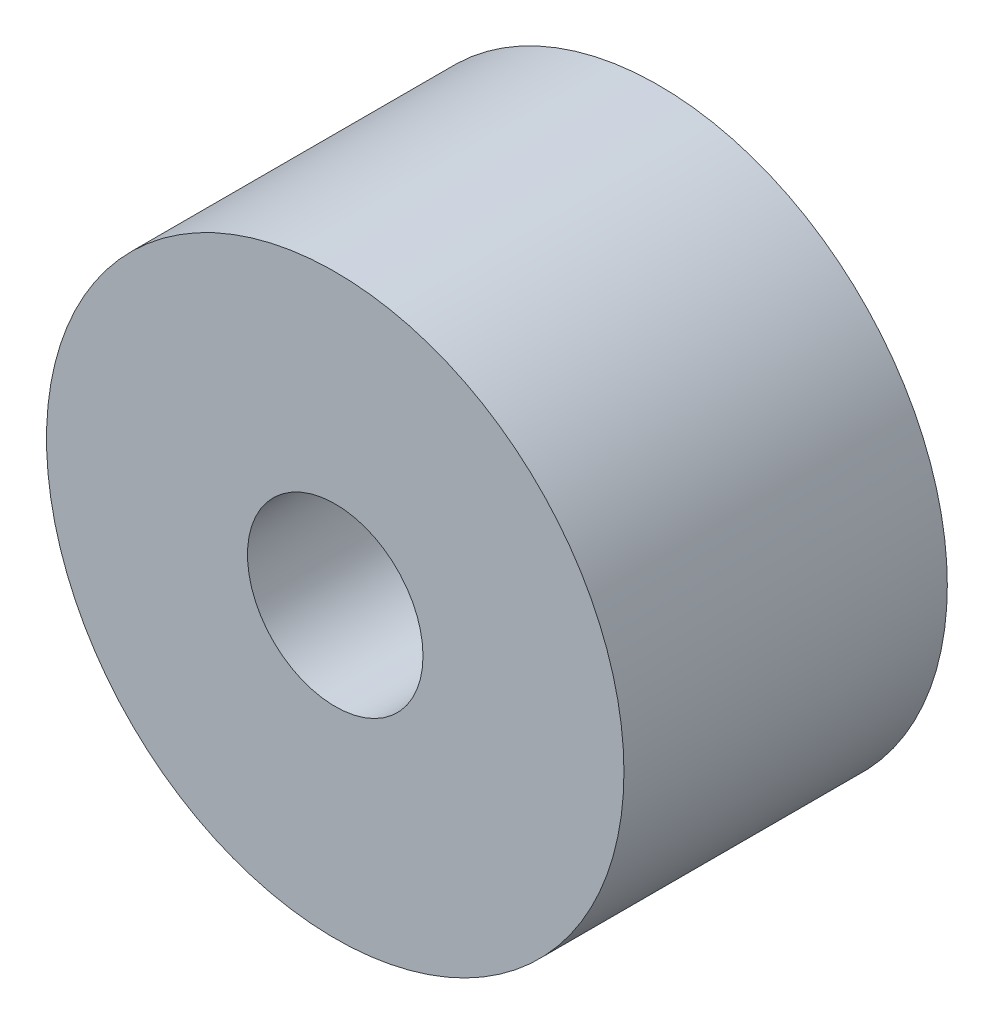
ISO-10303-21;
HEADER;
FILE_DESCRIPTION(('STEP AP214'),'2;1');
FILE_NAME('part.step','',(''),(''),'','','');
FILE_SCHEMA(('AUTOMOTIVE_DESIGN { 1 0 10303 214 1 1 1 1 }'));
ENDSEC;
DATA;
#1=APPLICATION_CONTEXT('core data for automotive mechanical design processes');
#2=APPLICATION_PROTOCOL_DEFINITION('international standard','automotive_design',2000,#1);
#3=PRODUCT_CONTEXT('',#1,'mechanical');
#4=PRODUCT('Part','Part','',(#3));
#5=PRODUCT_RELATED_PRODUCT_CATEGORY('part','',(#4));
#6=PRODUCT_DEFINITION_FORMATION('','',#4);
#7=PRODUCT_DEFINITION_CONTEXT('part definition',#1,'design');
#8=PRODUCT_DEFINITION('design','',#6,#7);
#9=PRODUCT_DEFINITION_SHAPE('','',#8);
#10=(LENGTH_UNIT() NAMED_UNIT(*) SI_UNIT(.MILLI.,.METRE.));
#11=(NAMED_UNIT(*) PLANE_ANGLE_UNIT() SI_UNIT($,.RADIAN.));
#12=(NAMED_UNIT(*) SI_UNIT($,.STERADIAN.) SOLID_ANGLE_UNIT());
#13=UNCERTAINTY_MEASURE_WITH_UNIT(LENGTH_MEASURE(1.E-05),#10,'distance_accuracy_value','');
#14=(GEOMETRIC_REPRESENTATION_CONTEXT(3) GLOBAL_UNCERTAINTY_ASSIGNED_CONTEXT((#13)) GLOBAL_UNIT_ASSIGNED_CONTEXT((#10,
#11,#12)) REPRESENTATION_CONTEXT('',''));
#15=CARTESIAN_POINT('',(0.,0.,0.));
#16=DIRECTION('',(0.,0.,1.));
#17=DIRECTION('',(1.,0.,0.));
#18=AXIS2_PLACEMENT_3D('',#15,#16,#17);
#19=CARTESIAN_POINT('',(0.,0.,70.));
#20=DIRECTION('',(0.,0.,1.));
#21=DIRECTION('',(1.,0.,0.));
#22=AXIS2_PLACEMENT_3D('',#19,#20,#21);
#23=PLANE('',#22);
#24=CARTESIAN_POINT('',(0.,0.,70.));
#25=DIRECTION('',(0.,0.,1.));
#26=DIRECTION('',(1.,0.,0.));
#27=AXIS2_PLACEMENT_3D('',#24,#25,#26);
#28=CIRCLE('',#27,62.5);
#29=CARTESIAN_POINT('',(62.5,0.,70.));
#30=VERTEX_POINT('',#29);
#31=EDGE_CURVE('E10',#30,#30,#28,.T.);
#32=ORIENTED_EDGE('',*,*,#31,.T.);
#33=EDGE_LOOP('',(#32));
#34=FACE_BOUND('',#33,.T.);
#35=CARTESIAN_POINT('',(0.,0.,70.));
#36=DIRECTION('',(0.,0.,1.));
#37=DIRECTION('',(1.,0.,0.));
#38=AXIS2_PLACEMENT_3D('',#35,#36,#37);
#39=CIRCLE('',#38,19.);
#40=CARTESIAN_POINT('',(19.,0.,70.));
#41=VERTEX_POINT('',#40);
#42=EDGE_CURVE('E50',#41,#41,#39,.T.);
#43=ORIENTED_EDGE('',*,*,#42,.F.);
#44=EDGE_LOOP('',(#43));
#45=FACE_BOUND('',#44,.T.);
#46=ADVANCED_FACE('F37',(#34,#45),#23,.T.);
#47=CARTESIAN_POINT('',(0.,0.,0.));
#48=DIRECTION('',(0.,0.,1.));
#49=DIRECTION('',(1.,0.,0.));
#50=AXIS2_PLACEMENT_3D('',#47,#48,#49);
#51=PLANE('',#50);
#52=CARTESIAN_POINT('',(0.,0.,0.));
#53=DIRECTION('',(0.,0.,1.));
#54=DIRECTION('',(1.,0.,0.));
#55=AXIS2_PLACEMENT_3D('',#52,#53,#54);
#56=CIRCLE('',#55,62.5);
#57=CARTESIAN_POINT('',(62.5,0.,0.));
#58=VERTEX_POINT('',#57);
#59=EDGE_CURVE('E41',#58,#58,#56,.T.);
#60=ORIENTED_EDGE('',*,*,#59,.F.);
#61=EDGE_LOOP('',(#60));
#62=FACE_BOUND('',#61,.T.);
#63=CARTESIAN_POINT('',(0.,0.,0.));
#64=DIRECTION('',(0.,0.,1.));
#65=DIRECTION('',(1.,0.,0.));
#66=AXIS2_PLACEMENT_3D('',#63,#64,#65);
#67=CIRCLE('',#66,19.);
#68=CARTESIAN_POINT('',(19.,0.,0.));
#69=VERTEX_POINT('',#68);
#70=EDGE_CURVE('E52',#69,#69,#67,.T.);
#71=ORIENTED_EDGE('',*,*,#70,.T.);
#72=EDGE_LOOP('',(#71));
#73=FACE_BOUND('',#72,.T.);
#74=ADVANCED_FACE('F64',(#62,#73),#51,.F.);
#75=CARTESIAN_POINT('',(0.,0.,70.));
#76=DIRECTION('',(0.,0.,-1.));
#77=DIRECTION('',(-1.,0.,0.));
#78=AXIS2_PLACEMENT_3D('',#75,#76,#77);
#79=CYLINDRICAL_SURFACE('',#78,62.5);
#80=ORIENTED_EDGE('',*,*,#31,.F.);
#81=EDGE_LOOP('',(#80));
#82=FACE_BOUND('',#81,.T.);
#83=ORIENTED_EDGE('',*,*,#59,.T.);
#84=EDGE_LOOP('',(#83));
#85=FACE_BOUND('',#84,.T.);
#86=ADVANCED_FACE('F39',(#82,#85),#79,.T.);
#87=CARTESIAN_POINT('',(0.,0.,70.));
#88=DIRECTION('',(0.,0.,-1.));
#89=DIRECTION('',(-1.,0.,0.));
#90=AXIS2_PLACEMENT_3D('',#87,#88,#89);
#91=CYLINDRICAL_SURFACE('',#90,19.);
#92=ORIENTED_EDGE('',*,*,#42,.T.);
#93=EDGE_LOOP('',(#92));
#94=FACE_BOUND('',#93,.T.);
#95=ORIENTED_EDGE('',*,*,#70,.F.);
#96=EDGE_LOOP('',(#95));
#97=FACE_BOUND('',#96,.T.);
#98=ADVANCED_FACE('F60',(#94,#97),#91,.F.);
#99=CLOSED_SHELL('',(#46,#74,#86,#98));
#100=MANIFOLD_SOLID_BREP('B2',#99);
#101=ADVANCED_BREP_SHAPE_REPRESENTATION('',(#18,#100),#14);
#102=SHAPE_DEFINITION_REPRESENTATION(#9,#101);
ENDSEC;
END-ISO-10303-21;
